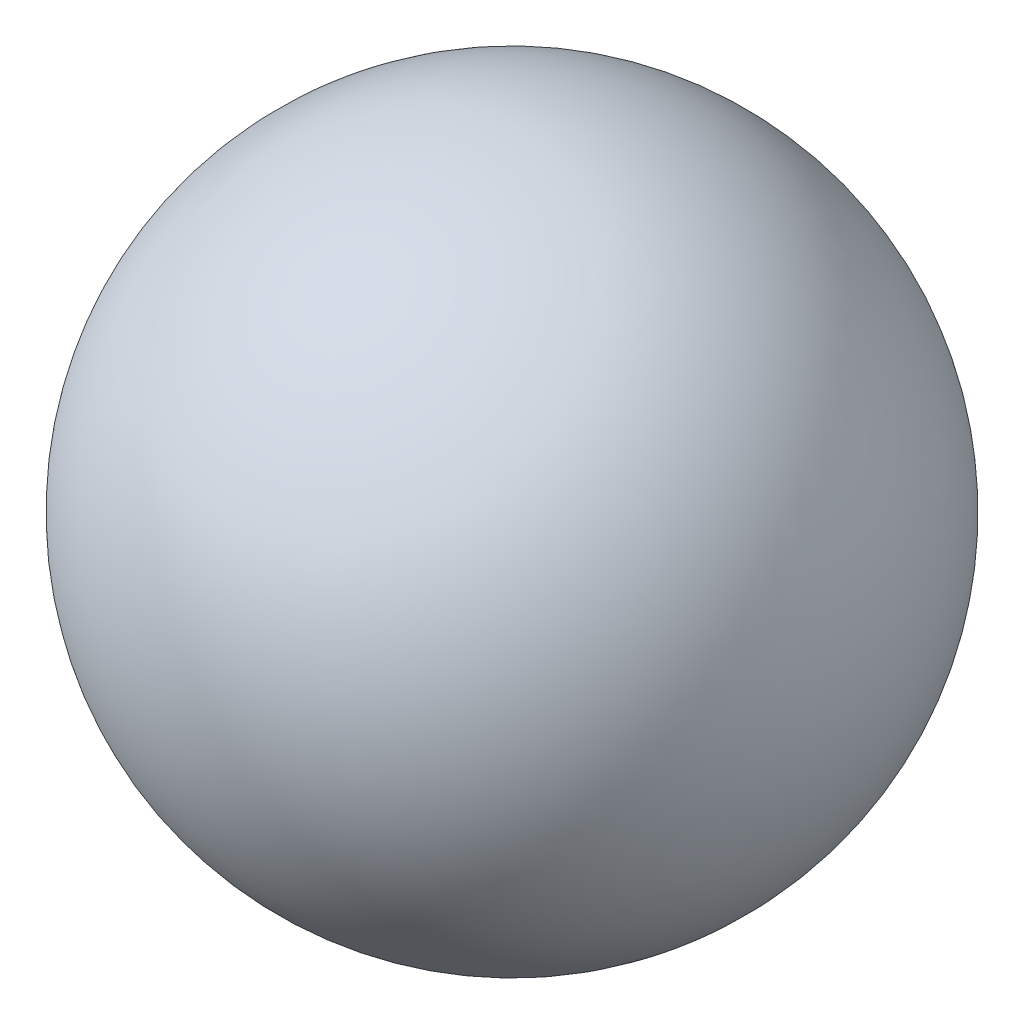
ISO-10303-21;
HEADER;
FILE_DESCRIPTION(('STEP AP214'),'2;1');
FILE_NAME('part.step','',(''),(''),'','','');
FILE_SCHEMA(('AUTOMOTIVE_DESIGN { 1 0 10303 214 1 1 1 1 }'));
ENDSEC;
DATA;
#1=APPLICATION_CONTEXT('core data for automotive mechanical design processes');
#2=APPLICATION_PROTOCOL_DEFINITION('international standard','automotive_design',2000,#1);
#3=PRODUCT_CONTEXT('',#1,'mechanical');
#4=PRODUCT('Part','Part','',(#3));
#5=PRODUCT_RELATED_PRODUCT_CATEGORY('part','',(#4));
#6=PRODUCT_DEFINITION_FORMATION('','',#4);
#7=PRODUCT_DEFINITION_CONTEXT('part definition',#1,'design');
#8=PRODUCT_DEFINITION('design','',#6,#7);
#9=PRODUCT_DEFINITION_SHAPE('','',#8);
#10=(LENGTH_UNIT() NAMED_UNIT(*) SI_UNIT(.MILLI.,.METRE.));
#11=(NAMED_UNIT(*) PLANE_ANGLE_UNIT() SI_UNIT($,.RADIAN.));
#12=(NAMED_UNIT(*) SI_UNIT($,.STERADIAN.) SOLID_ANGLE_UNIT());
#13=UNCERTAINTY_MEASURE_WITH_UNIT(LENGTH_MEASURE(1.E-05),#10,'distance_accuracy_value','');
#14=(GEOMETRIC_REPRESENTATION_CONTEXT(3) GLOBAL_UNCERTAINTY_ASSIGNED_CONTEXT((#13)) GLOBAL_UNIT_ASSIGNED_CONTEXT((#10,
#11,#12)) REPRESENTATION_CONTEXT('',''));
#15=CARTESIAN_POINT('',(0.,0.,0.));
#16=DIRECTION('',(0.,0.,1.));
#17=DIRECTION('',(1.,0.,0.));
#18=AXIS2_PLACEMENT_3D('',#15,#16,#17);
#19=CARTESIAN_POINT('',(-5.19615242270667,-3.00000000000056,2.));
#20=DIRECTION('',(-0.499999999999989,0.866025403784445,0.));
#21=DIRECTION('',(0.,0.,-1.));
#22=AXIS2_PLACEMENT_3D('',#19,#20,#21);
#23=SPHERICAL_SURFACE('',#22,1.04);
#24=CARTESIAN_POINT('',(-4.67615242270668,-3.90066641993638,2.));
#25=VERTEX_POINT('',#24);
#26=VERTEX_LOOP('',#25);
#27=FACE_BOUND('',#26,.T.);
#28=ADVANCED_FACE('F15',(#27),#23,.T.);
#29=CLOSED_SHELL('',(#28));
#30=MANIFOLD_SOLID_BREP('B1',#29);
#31=ADVANCED_BREP_SHAPE_REPRESENTATION('',(#18,#30),#14);
#32=SHAPE_DEFINITION_REPRESENTATION(#9,#31);
ENDSEC;
END-ISO-10303-21;
